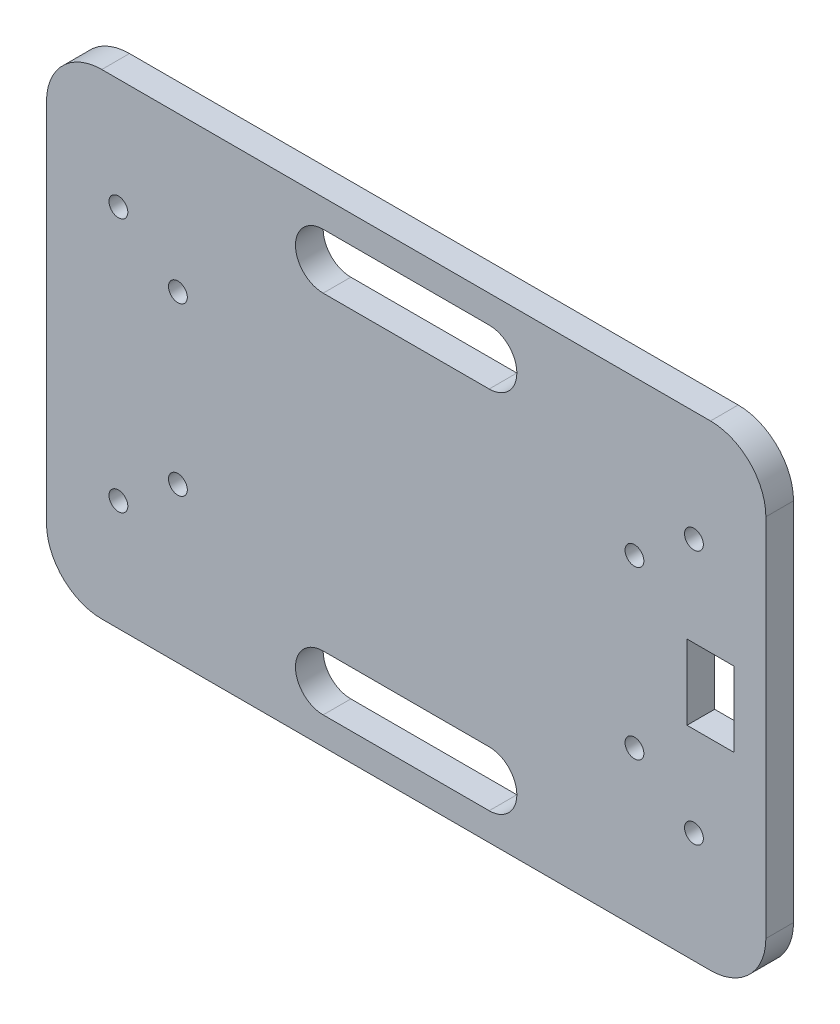
ISO-10303-21;
HEADER;
FILE_DESCRIPTION(('STEP AP214'),'2;1');
FILE_NAME('part.step','',(''),(''),'','','');
FILE_SCHEMA(('AUTOMOTIVE_DESIGN { 1 0 10303 214 1 1 1 1 }'));
ENDSEC;
DATA;
#1=APPLICATION_CONTEXT('core data for automotive mechanical design processes');
#2=APPLICATION_PROTOCOL_DEFINITION('international standard','automotive_design',2000,#1);
#3=PRODUCT_CONTEXT('',#1,'mechanical');
#4=PRODUCT('Part','Part','',(#3));
#5=PRODUCT_RELATED_PRODUCT_CATEGORY('part','',(#4));
#6=PRODUCT_DEFINITION_FORMATION('','',#4);
#7=PRODUCT_DEFINITION_CONTEXT('part definition',#1,'design');
#8=PRODUCT_DEFINITION('design','',#6,#7);
#9=PRODUCT_DEFINITION_SHAPE('','',#8);
#10=(LENGTH_UNIT() NAMED_UNIT(*) SI_UNIT(.MILLI.,.METRE.));
#11=(NAMED_UNIT(*) PLANE_ANGLE_UNIT() SI_UNIT($,.RADIAN.));
#12=(NAMED_UNIT(*) SI_UNIT($,.STERADIAN.) SOLID_ANGLE_UNIT());
#13=UNCERTAINTY_MEASURE_WITH_UNIT(LENGTH_MEASURE(1.E-05),#10,'distance_accuracy_value','');
#14=(GEOMETRIC_REPRESENTATION_CONTEXT(3) GLOBAL_UNCERTAINTY_ASSIGNED_CONTEXT((#13)) GLOBAL_UNIT_ASSIGNED_CONTEXT((#10,
#11,#12)) REPRESENTATION_CONTEXT('',''));
#15=CARTESIAN_POINT('',(0.,0.,0.));
#16=DIRECTION('',(0.,0.,1.));
#17=DIRECTION('',(1.,0.,0.));
#18=AXIS2_PLACEMENT_3D('',#15,#16,#17);
#19=CARTESIAN_POINT('',(-55.,33.,5.));
#20=DIRECTION('',(0.,0.,-1.));
#21=DIRECTION('',(-1.,0.,0.));
#22=AXIS2_PLACEMENT_3D('',#19,#20,#21);
#23=CYLINDRICAL_SURFACE('',#22,10.);
#24=CARTESIAN_POINT('',(-55.,33.,0.));
#25=DIRECTION('',(0.,0.,1.));
#26=DIRECTION('',(-1.,0.,0.));
#27=AXIS2_PLACEMENT_3D('',#24,#25,#26);
#28=CIRCLE('',#27,10.);
#29=CARTESIAN_POINT('',(-55.,43.,0.));
#30=VERTEX_POINT('',#29);
#31=CARTESIAN_POINT('',(-65.,33.,0.));
#32=VERTEX_POINT('',#31);
#33=EDGE_CURVE('E224',#30,#32,#28,.T.);
#34=ORIENTED_EDGE('',*,*,#33,.T.);
#35=DIRECTION('',(0.,0.,-1.));
#36=VECTOR('',#35,1.);
#37=CARTESIAN_POINT('',(-65.,33.,5.));
#38=LINE('',#37,#36);
#39=CARTESIAN_POINT('',(-65.,33.,5.));
#40=VERTEX_POINT('',#39);
#41=EDGE_CURVE('E11',#40,#32,#38,.T.);
#42=ORIENTED_EDGE('',*,*,#41,.F.);
#43=CARTESIAN_POINT('',(-55.,33.,5.));
#44=DIRECTION('',(0.,0.,1.));
#45=DIRECTION('',(-1.,0.,0.));
#46=AXIS2_PLACEMENT_3D('',#43,#44,#45);
#47=CIRCLE('',#46,10.);
#48=CARTESIAN_POINT('',(-55.,43.,5.));
#49=VERTEX_POINT('',#48);
#50=EDGE_CURVE('E378',#49,#40,#47,.T.);
#51=ORIENTED_EDGE('',*,*,#50,.F.);
#52=DIRECTION('',(0.,0.,-1.));
#53=VECTOR('',#52,1.);
#54=CARTESIAN_POINT('',(-55.,43.,5.));
#55=LINE('',#54,#53);
#56=EDGE_CURVE('E404',#49,#30,#55,.T.);
#57=ORIENTED_EDGE('',*,*,#56,.T.);
#58=EDGE_LOOP('',(#34,#42,#51,#57));
#59=FACE_BOUND('',#58,.T.);
#60=ADVANCED_FACE('F39',(#59),#23,.T.);
#61=CARTESIAN_POINT('',(-65.,33.,5.));
#62=DIRECTION('',(1.,0.,0.));
#63=DIRECTION('',(0.,1.,0.));
#64=AXIS2_PLACEMENT_3D('',#61,#62,#63);
#65=PLANE('',#64);
#66=DIRECTION('',(0.,-1.,0.));
#67=VECTOR('',#66,1.);
#68=CARTESIAN_POINT('',(-65.,33.,0.));
#69=LINE('',#68,#67);
#70=CARTESIAN_POINT('',(-65.,-33.,0.));
#71=VERTEX_POINT('',#70);
#72=EDGE_CURVE('E408',#32,#71,#69,.T.);
#73=ORIENTED_EDGE('',*,*,#72,.T.);
#74=DIRECTION('',(0.,0.,-1.));
#75=VECTOR('',#74,1.);
#76=CARTESIAN_POINT('',(-65.,-33.,5.));
#77=LINE('',#76,#75);
#78=CARTESIAN_POINT('',(-65.,-33.,5.));
#79=VERTEX_POINT('',#78);
#80=EDGE_CURVE('E47',#79,#71,#77,.T.);
#81=ORIENTED_EDGE('',*,*,#80,.F.);
#82=DIRECTION('',(0.,-1.,0.));
#83=VECTOR('',#82,1.);
#84=CARTESIAN_POINT('',(-65.,33.,5.));
#85=LINE('',#84,#83);
#86=EDGE_CURVE('E382',#40,#79,#85,.T.);
#87=ORIENTED_EDGE('',*,*,#86,.F.);
#88=ORIENTED_EDGE('',*,*,#41,.T.);
#89=EDGE_LOOP('',(#73,#81,#87,#88));
#90=FACE_BOUND('',#89,.T.);
#91=ADVANCED_FACE('F478',(#90),#65,.F.);
#92=CARTESIAN_POINT('',(-55.,-33.,5.));
#93=DIRECTION('',(0.,0.,-1.));
#94=DIRECTION('',(-1.,0.,0.));
#95=AXIS2_PLACEMENT_3D('',#92,#93,#94);
#96=CYLINDRICAL_SURFACE('',#95,9.99999999999999);
#97=CARTESIAN_POINT('',(-55.,-33.,0.));
#98=DIRECTION('',(0.,0.,1.));
#99=DIRECTION('',(-1.,0.,0.));
#100=AXIS2_PLACEMENT_3D('',#97,#98,#99);
#101=CIRCLE('',#100,9.99999999999999);
#102=CARTESIAN_POINT('',(-55.,-43.,0.));
#103=VERTEX_POINT('',#102);
#104=EDGE_CURVE('E411',#71,#103,#101,.T.);
#105=ORIENTED_EDGE('',*,*,#104,.T.);
#106=DIRECTION('',(0.,0.,-1.));
#107=VECTOR('',#106,1.);
#108=CARTESIAN_POINT('',(-55.,-43.,5.));
#109=LINE('',#108,#107);
#110=CARTESIAN_POINT('',(-55.,-43.,5.));
#111=VERTEX_POINT('',#110);
#112=EDGE_CURVE('E447',#111,#103,#109,.T.);
#113=ORIENTED_EDGE('',*,*,#112,.F.);
#114=CARTESIAN_POINT('',(-55.,-33.,5.));
#115=DIRECTION('',(0.,0.,1.));
#116=DIRECTION('',(-1.,0.,0.));
#117=AXIS2_PLACEMENT_3D('',#114,#115,#116);
#118=CIRCLE('',#117,9.99999999999999);
#119=EDGE_CURVE('E386',#79,#111,#118,.T.);
#120=ORIENTED_EDGE('',*,*,#119,.F.);
#121=ORIENTED_EDGE('',*,*,#80,.T.);
#122=EDGE_LOOP('',(#105,#113,#120,#121));
#123=FACE_BOUND('',#122,.T.);
#124=ADVANCED_FACE('F456',(#123),#96,.T.);
#125=CARTESIAN_POINT('',(-55.,-43.,5.));
#126=DIRECTION('',(0.,1.,0.));
#127=DIRECTION('',(0.,0.,1.));
#128=AXIS2_PLACEMENT_3D('',#125,#126,#127);
#129=PLANE('',#128);
#130=DIRECTION('',(1.,0.,0.));
#131=VECTOR('',#130,1.);
#132=CARTESIAN_POINT('',(-55.,-43.,0.));
#133=LINE('',#132,#131);
#134=CARTESIAN_POINT('',(55.,-43.,0.));
#135=VERTEX_POINT('',#134);
#136=EDGE_CURVE('E414',#103,#135,#133,.T.);
#137=ORIENTED_EDGE('',*,*,#136,.T.);
#138=DIRECTION('',(0.,0.,-1.));
#139=VECTOR('',#138,1.);
#140=CARTESIAN_POINT('',(55.,-43.,5.));
#141=LINE('',#140,#139);
#142=CARTESIAN_POINT('',(55.,-43.,5.));
#143=VERTEX_POINT('',#142);
#144=EDGE_CURVE('E443',#143,#135,#141,.T.);
#145=ORIENTED_EDGE('',*,*,#144,.F.);
#146=DIRECTION('',(1.,0.,0.));
#147=VECTOR('',#146,1.);
#148=CARTESIAN_POINT('',(-55.,-43.,5.));
#149=LINE('',#148,#147);
#150=EDGE_CURVE('E389',#111,#143,#149,.T.);
#151=ORIENTED_EDGE('',*,*,#150,.F.);
#152=ORIENTED_EDGE('',*,*,#112,.T.);
#153=EDGE_LOOP('',(#137,#145,#151,#152));
#154=FACE_BOUND('',#153,.T.);
#155=ADVANCED_FACE('F466',(#154),#129,.F.);
#156=CARTESIAN_POINT('',(55.,-33.,5.));
#157=DIRECTION('',(0.,0.,-1.));
#158=DIRECTION('',(-1.,0.,0.));
#159=AXIS2_PLACEMENT_3D('',#156,#157,#158);
#160=CYLINDRICAL_SURFACE('',#159,10.);
#161=CARTESIAN_POINT('',(55.,-33.,0.));
#162=DIRECTION('',(0.,0.,1.));
#163=DIRECTION('',(1.,0.,0.));
#164=AXIS2_PLACEMENT_3D('',#161,#162,#163);
#165=CIRCLE('',#164,10.);
#166=CARTESIAN_POINT('',(65.,-33.,0.));
#167=VERTEX_POINT('',#166);
#168=EDGE_CURVE('E417',#135,#167,#165,.T.);
#169=ORIENTED_EDGE('',*,*,#168,.T.);
#170=DIRECTION('',(0.,0.,-1.));
#171=VECTOR('',#170,1.);
#172=CARTESIAN_POINT('',(65.,-33.,5.));
#173=LINE('',#172,#171);
#174=CARTESIAN_POINT('',(65.,-33.,5.));
#175=VERTEX_POINT('',#174);
#176=EDGE_CURVE('E439',#175,#167,#173,.T.);
#177=ORIENTED_EDGE('',*,*,#176,.F.);
#178=CARTESIAN_POINT('',(55.,-33.,5.));
#179=DIRECTION('',(0.,0.,1.));
#180=DIRECTION('',(1.,0.,0.));
#181=AXIS2_PLACEMENT_3D('',#178,#179,#180);
#182=CIRCLE('',#181,10.);
#183=EDGE_CURVE('E392',#143,#175,#182,.T.);
#184=ORIENTED_EDGE('',*,*,#183,.F.);
#185=ORIENTED_EDGE('',*,*,#144,.T.);
#186=EDGE_LOOP('',(#169,#177,#184,#185));
#187=FACE_BOUND('',#186,.T.);
#188=ADVANCED_FACE('F470',(#187),#160,.T.);
#189=CARTESIAN_POINT('',(65.,33.,5.));
#190=DIRECTION('',(-1.,0.,0.));
#191=DIRECTION('',(0.,-1.,0.));
#192=AXIS2_PLACEMENT_3D('',#189,#190,#191);
#193=PLANE('',#192);
#194=DIRECTION('',(0.,1.,0.));
#195=VECTOR('',#194,1.);
#196=CARTESIAN_POINT('',(65.,33.,0.));
#197=LINE('',#196,#195);
#198=CARTESIAN_POINT('',(65.,33.,0.));
#199=VERTEX_POINT('',#198);
#200=EDGE_CURVE('E420',#167,#199,#197,.T.);
#201=ORIENTED_EDGE('',*,*,#200,.T.);
#202=DIRECTION('',(0.,0.,-1.));
#203=VECTOR('',#202,1.);
#204=CARTESIAN_POINT('',(65.,33.,5.));
#205=LINE('',#204,#203);
#206=CARTESIAN_POINT('',(65.,33.,5.));
#207=VERTEX_POINT('',#206);
#208=EDGE_CURVE('E435',#207,#199,#205,.T.);
#209=ORIENTED_EDGE('',*,*,#208,.F.);
#210=DIRECTION('',(0.,1.,0.));
#211=VECTOR('',#210,1.);
#212=CARTESIAN_POINT('',(65.,33.,5.));
#213=LINE('',#212,#211);
#214=EDGE_CURVE('E395',#175,#207,#213,.T.);
#215=ORIENTED_EDGE('',*,*,#214,.F.);
#216=ORIENTED_EDGE('',*,*,#176,.T.);
#217=EDGE_LOOP('',(#201,#209,#215,#216));
#218=FACE_BOUND('',#217,.T.);
#219=ADVANCED_FACE('F491',(#218),#193,.F.);
#220=CARTESIAN_POINT('',(55.,33.,5.));
#221=DIRECTION('',(0.,0.,-1.));
#222=DIRECTION('',(-1.,0.,0.));
#223=AXIS2_PLACEMENT_3D('',#220,#221,#222);
#224=CYLINDRICAL_SURFACE('',#223,10.);
#225=CARTESIAN_POINT('',(55.,33.,0.));
#226=DIRECTION('',(0.,0.,1.));
#227=DIRECTION('',(1.,0.,0.));
#228=AXIS2_PLACEMENT_3D('',#225,#226,#227);
#229=CIRCLE('',#228,10.);
#230=CARTESIAN_POINT('',(55.,43.,0.));
#231=VERTEX_POINT('',#230);
#232=EDGE_CURVE('E423',#199,#231,#229,.T.);
#233=ORIENTED_EDGE('',*,*,#232,.T.);
#234=DIRECTION('',(0.,0.,-1.));
#235=VECTOR('',#234,1.);
#236=CARTESIAN_POINT('',(55.,43.,5.));
#237=LINE('',#236,#235);
#238=CARTESIAN_POINT('',(55.,43.,5.));
#239=VERTEX_POINT('',#238);
#240=EDGE_CURVE('E431',#239,#231,#237,.T.);
#241=ORIENTED_EDGE('',*,*,#240,.F.);
#242=CARTESIAN_POINT('',(55.,33.,5.));
#243=DIRECTION('',(0.,0.,1.));
#244=DIRECTION('',(1.,0.,0.));
#245=AXIS2_PLACEMENT_3D('',#242,#243,#244);
#246=CIRCLE('',#245,10.);
#247=EDGE_CURVE('E398',#207,#239,#246,.T.);
#248=ORIENTED_EDGE('',*,*,#247,.F.);
#249=ORIENTED_EDGE('',*,*,#208,.T.);
#250=EDGE_LOOP('',(#233,#241,#248,#249));
#251=FACE_BOUND('',#250,.T.);
#252=ADVANCED_FACE('F489',(#251),#224,.T.);
#253=CARTESIAN_POINT('',(-55.,43.,5.));
#254=DIRECTION('',(0.,-1.,0.));
#255=DIRECTION('',(0.,0.,-1.));
#256=AXIS2_PLACEMENT_3D('',#253,#254,#255);
#257=PLANE('',#256);
#258=DIRECTION('',(-1.,0.,0.));
#259=VECTOR('',#258,1.);
#260=CARTESIAN_POINT('',(-55.,43.,0.));
#261=LINE('',#260,#259);
#262=EDGE_CURVE('E383',#231,#30,#261,.T.);
#263=ORIENTED_EDGE('',*,*,#262,.T.);
#264=ORIENTED_EDGE('',*,*,#56,.F.);
#265=DIRECTION('',(-1.,0.,0.));
#266=VECTOR('',#265,1.);
#267=CARTESIAN_POINT('',(-55.,43.,5.));
#268=LINE('',#267,#266);
#269=EDGE_CURVE('E401',#239,#49,#268,.T.);
#270=ORIENTED_EDGE('',*,*,#269,.F.);
#271=ORIENTED_EDGE('',*,*,#240,.T.);
#272=EDGE_LOOP('',(#263,#264,#270,#271));
#273=FACE_BOUND('',#272,.T.);
#274=ADVANCED_FACE('F484',(#273),#257,.F.);
#275=CARTESIAN_POINT('',(-55.,33.,5.));
#276=DIRECTION('',(0.,0.,-1.));
#277=DIRECTION('',(-1.,0.,0.));
#278=AXIS2_PLACEMENT_3D('',#275,#276,#277);
#279=PLANE('',#278);
#280=CARTESIAN_POINT('',(15.,-33.,5.));
#281=DIRECTION('',(0.,0.,1.));
#282=DIRECTION('',(1.,0.,0.));
#283=AXIS2_PLACEMENT_3D('',#280,#281,#282);
#284=CIRCLE('',#283,5.);
#285=CARTESIAN_POINT('',(15.,-38.,5.));
#286=VERTEX_POINT('',#285);
#287=CARTESIAN_POINT('',(15.,-28.,5.));
#288=VERTEX_POINT('',#287);
#289=EDGE_CURVE('E214',#286,#288,#284,.T.);
#290=ORIENTED_EDGE('',*,*,#289,.F.);
#291=DIRECTION('',(1.,0.,0.));
#292=VECTOR('',#291,1.);
#293=CARTESIAN_POINT('',(0.,-38.,5.));
#294=LINE('',#293,#292);
#295=CARTESIAN_POINT('',(-15.,-38.,5.));
#296=VERTEX_POINT('',#295);
#297=EDGE_CURVE('E54',#296,#286,#294,.T.);
#298=ORIENTED_EDGE('',*,*,#297,.F.);
#299=CARTESIAN_POINT('',(-15.,-33.,5.));
#300=DIRECTION('',(0.,0.,1.));
#301=DIRECTION('',(1.,0.,0.));
#302=AXIS2_PLACEMENT_3D('',#299,#300,#301);
#303=CIRCLE('',#302,5.);
#304=CARTESIAN_POINT('',(-15.,-28.,5.));
#305=VERTEX_POINT('',#304);
#306=EDGE_CURVE('E201',#305,#296,#303,.T.);
#307=ORIENTED_EDGE('',*,*,#306,.F.);
#308=DIRECTION('',(1.,0.,0.));
#309=VECTOR('',#308,1.);
#310=CARTESIAN_POINT('',(0.,-28.,5.));
#311=LINE('',#310,#309);
#312=EDGE_CURVE('E205',#305,#288,#311,.T.);
#313=ORIENTED_EDGE('',*,*,#312,.T.);
#314=EDGE_LOOP('',(#290,#298,#307,#313));
#315=FACE_BOUND('',#314,.T.);
#316=DIRECTION('',(0.,-1.,0.));
#317=VECTOR('',#316,1.);
#318=CARTESIAN_POINT('',(59.25,6.74999999999996,5.));
#319=LINE('',#318,#317);
#320=CARTESIAN_POINT('',(59.25,6.74999999999996,5.));
#321=VERTEX_POINT('',#320);
#322=CARTESIAN_POINT('',(59.25,-6.75000000000004,5.));
#323=VERTEX_POINT('',#322);
#324=EDGE_CURVE('E261',#321,#323,#319,.T.);
#325=ORIENTED_EDGE('',*,*,#324,.T.);
#326=DIRECTION('',(1.,0.,0.));
#327=VECTOR('',#326,1.);
#328=CARTESIAN_POINT('',(50.75,-6.75000000000004,5.));
#329=LINE('',#328,#327);
#330=CARTESIAN_POINT('',(50.75,-6.75000000000004,5.));
#331=VERTEX_POINT('',#330);
#332=EDGE_CURVE('E62',#331,#323,#329,.T.);
#333=ORIENTED_EDGE('',*,*,#332,.F.);
#334=DIRECTION('',(0.,-1.,0.));
#335=VECTOR('',#334,1.);
#336=CARTESIAN_POINT('',(50.75,6.74999999999996,5.));
#337=LINE('',#336,#335);
#338=CARTESIAN_POINT('',(50.75,6.74999999999996,5.));
#339=VERTEX_POINT('',#338);
#340=EDGE_CURVE('E252',#339,#331,#337,.T.);
#341=ORIENTED_EDGE('',*,*,#340,.F.);
#342=DIRECTION('',(1.,0.,0.));
#343=VECTOR('',#342,1.);
#344=CARTESIAN_POINT('',(50.75,6.74999999999996,5.));
#345=LINE('',#344,#343);
#346=EDGE_CURVE('E256',#339,#321,#345,.T.);
#347=ORIENTED_EDGE('',*,*,#346,.T.);
#348=EDGE_LOOP('',(#325,#333,#341,#347));
#349=FACE_BOUND('',#348,.T.);
#350=CARTESIAN_POINT('',(52.,23.0000000000001,5.));
#351=DIRECTION('',(0.,0.,1.));
#352=DIRECTION('',(1.,0.,0.));
#353=AXIS2_PLACEMENT_3D('',#350,#351,#352);
#354=CIRCLE('',#353,1.7);
#355=CARTESIAN_POINT('',(53.7,23.0000000000001,5.));
#356=VERTEX_POINT('',#355);
#357=EDGE_CURVE('E230',#356,#356,#354,.T.);
#358=ORIENTED_EDGE('',*,*,#357,.F.);
#359=EDGE_LOOP('',(#358));
#360=FACE_BOUND('',#359,.T.);
#361=CARTESIAN_POINT('',(15.,33.,5.));
#362=DIRECTION('',(0.,0.,1.));
#363=DIRECTION('',(1.,0.,0.));
#364=AXIS2_PLACEMENT_3D('',#361,#362,#363);
#365=CIRCLE('',#364,5.);
#366=CARTESIAN_POINT('',(15.,28.,5.));
#367=VERTEX_POINT('',#366);
#368=CARTESIAN_POINT('',(15.,38.,5.));
#369=VERTEX_POINT('',#368);
#370=EDGE_CURVE('E336',#367,#369,#365,.T.);
#371=ORIENTED_EDGE('',*,*,#370,.F.);
#372=DIRECTION('',(1.,0.,0.));
#373=VECTOR('',#372,1.);
#374=CARTESIAN_POINT('',(0.,28.,5.));
#375=LINE('',#374,#373);
#376=CARTESIAN_POINT('',(-15.,28.,5.));
#377=VERTEX_POINT('',#376);
#378=EDGE_CURVE('E215',#377,#367,#375,.T.);
#379=ORIENTED_EDGE('',*,*,#378,.F.);
#380=CARTESIAN_POINT('',(-15.,33.,5.));
#381=DIRECTION('',(0.,0.,1.));
#382=DIRECTION('',(1.,0.,0.));
#383=AXIS2_PLACEMENT_3D('',#380,#381,#382);
#384=CIRCLE('',#383,5.);
#385=CARTESIAN_POINT('',(-15.,38.,5.));
#386=VERTEX_POINT('',#385);
#387=EDGE_CURVE('E327',#386,#377,#384,.T.);
#388=ORIENTED_EDGE('',*,*,#387,.F.);
#389=DIRECTION('',(1.,0.,0.));
#390=VECTOR('',#389,1.);
#391=CARTESIAN_POINT('',(0.,38.,5.));
#392=LINE('',#391,#390);
#393=EDGE_CURVE('E331',#386,#369,#392,.T.);
#394=ORIENTED_EDGE('',*,*,#393,.T.);
#395=EDGE_LOOP('',(#371,#379,#388,#394));
#396=FACE_BOUND('',#395,.T.);
#397=CARTESIAN_POINT('',(-52.,23.,5.));
#398=DIRECTION('',(0.,0.,1.));
#399=DIRECTION('',(1.,0.,0.));
#400=AXIS2_PLACEMENT_3D('',#397,#398,#399);
#401=CIRCLE('',#400,1.7);
#402=CARTESIAN_POINT('',(-50.3,23.,5.));
#403=VERTEX_POINT('',#402);
#404=EDGE_CURVE('E326',#403,#403,#401,.T.);
#405=ORIENTED_EDGE('',*,*,#404,.F.);
#406=EDGE_LOOP('',(#405));
#407=FACE_BOUND('',#406,.T.);
#408=CARTESIAN_POINT('',(-41.25,15.075,5.));
#409=DIRECTION('',(0.,0.,1.));
#410=DIRECTION('',(1.,0.,0.));
#411=AXIS2_PLACEMENT_3D('',#408,#409,#410);
#412=CIRCLE('',#411,1.7);
#413=CARTESIAN_POINT('',(-39.55,15.075,5.));
#414=VERTEX_POINT('',#413);
#415=EDGE_CURVE('E363',#414,#414,#412,.T.);
#416=ORIENTED_EDGE('',*,*,#415,.F.);
#417=EDGE_LOOP('',(#416));
#418=FACE_BOUND('',#417,.T.);
#419=CARTESIAN_POINT('',(-41.25,-15.05,5.));
#420=DIRECTION('',(0.,0.,1.));
#421=DIRECTION('',(1.,0.,0.));
#422=AXIS2_PLACEMENT_3D('',#419,#420,#421);
#423=CIRCLE('',#422,1.7);
#424=CARTESIAN_POINT('',(-39.55,-15.05,5.));
#425=VERTEX_POINT('',#424);
#426=EDGE_CURVE('E371',#425,#425,#423,.T.);
#427=ORIENTED_EDGE('',*,*,#426,.F.);
#428=EDGE_LOOP('',(#427));
#429=FACE_BOUND('',#428,.T.);
#430=CARTESIAN_POINT('',(52.,-23.,5.));
#431=DIRECTION('',(0.,0.,1.));
#432=DIRECTION('',(1.,0.,0.));
#433=AXIS2_PLACEMENT_3D('',#430,#431,#432);
#434=CIRCLE('',#433,1.7);
#435=CARTESIAN_POINT('',(53.7,-23.,5.));
#436=VERTEX_POINT('',#435);
#437=EDGE_CURVE('E289',#436,#436,#434,.T.);
#438=ORIENTED_EDGE('',*,*,#437,.F.);
#439=EDGE_LOOP('',(#438));
#440=FACE_BOUND('',#439,.T.);
#441=CARTESIAN_POINT('',(41.25,-15.05,5.));
#442=DIRECTION('',(0.,0.,1.));
#443=DIRECTION('',(1.,0.,0.));
#444=AXIS2_PLACEMENT_3D('',#441,#442,#443);
#445=CIRCLE('',#444,1.7);
#446=CARTESIAN_POINT('',(42.95,-15.05,5.));
#447=VERTEX_POINT('',#446);
#448=EDGE_CURVE('E280',#447,#447,#445,.T.);
#449=ORIENTED_EDGE('',*,*,#448,.F.);
#450=EDGE_LOOP('',(#449));
#451=FACE_BOUND('',#450,.T.);
#452=CARTESIAN_POINT('',(41.25,15.075,5.));
#453=DIRECTION('',(0.,0.,1.));
#454=DIRECTION('',(1.,0.,0.));
#455=AXIS2_PLACEMENT_3D('',#452,#453,#454);
#456=CIRCLE('',#455,1.7);
#457=CARTESIAN_POINT('',(42.95,15.075,5.));
#458=VERTEX_POINT('',#457);
#459=EDGE_CURVE('E305',#458,#458,#456,.T.);
#460=ORIENTED_EDGE('',*,*,#459,.F.);
#461=EDGE_LOOP('',(#460));
#462=FACE_BOUND('',#461,.T.);
#463=CARTESIAN_POINT('',(-52.,-23.,5.));
#464=DIRECTION('',(0.,0.,1.));
#465=DIRECTION('',(1.,0.,0.));
#466=AXIS2_PLACEMENT_3D('',#463,#464,#465);
#467=CIRCLE('',#466,1.7);
#468=CARTESIAN_POINT('',(-50.3,-23.,5.));
#469=VERTEX_POINT('',#468);
#470=EDGE_CURVE('E296',#469,#469,#467,.T.);
#471=ORIENTED_EDGE('',*,*,#470,.F.);
#472=EDGE_LOOP('',(#471));
#473=FACE_BOUND('',#472,.T.);
#474=ORIENTED_EDGE('',*,*,#50,.T.);
#475=ORIENTED_EDGE('',*,*,#86,.T.);
#476=ORIENTED_EDGE('',*,*,#119,.T.);
#477=ORIENTED_EDGE('',*,*,#150,.T.);
#478=ORIENTED_EDGE('',*,*,#183,.T.);
#479=ORIENTED_EDGE('',*,*,#214,.T.);
#480=ORIENTED_EDGE('',*,*,#247,.T.);
#481=ORIENTED_EDGE('',*,*,#269,.T.);
#482=EDGE_LOOP('',(#474,#475,#476,#477,#478,#479,#480,#481));
#483=FACE_BOUND('',#482,.T.);
#484=ADVANCED_FACE('F474',(#315,#349,#360,#396,#407,#418,#429,#440,#451,#462,#473,#483),#279,.F.);
#485=CARTESIAN_POINT('',(-55.,33.,0.));
#486=DIRECTION('',(0.,0.,-1.));
#487=DIRECTION('',(-1.,0.,0.));
#488=AXIS2_PLACEMENT_3D('',#485,#486,#487);
#489=PLANE('',#488);
#490=DIRECTION('',(1.,0.,0.));
#491=VECTOR('',#490,1.);
#492=CARTESIAN_POINT('',(0.,-38.,0.));
#493=LINE('',#492,#491);
#494=CARTESIAN_POINT('',(-15.,-38.,0.));
#495=VERTEX_POINT('',#494);
#496=CARTESIAN_POINT('',(15.,-38.,0.));
#497=VERTEX_POINT('',#496);
#498=EDGE_CURVE('E179',#495,#497,#493,.T.);
#499=ORIENTED_EDGE('',*,*,#498,.T.);
#500=CARTESIAN_POINT('',(15.,-33.,0.));
#501=DIRECTION('',(0.,0.,1.));
#502=DIRECTION('',(1.,0.,0.));
#503=AXIS2_PLACEMENT_3D('',#500,#501,#502);
#504=CIRCLE('',#503,5.);
#505=CARTESIAN_POINT('',(15.,-28.,0.));
#506=VERTEX_POINT('',#505);
#507=EDGE_CURVE('E189',#497,#506,#504,.T.);
#508=ORIENTED_EDGE('',*,*,#507,.T.);
#509=DIRECTION('',(1.,0.,0.));
#510=VECTOR('',#509,1.);
#511=CARTESIAN_POINT('',(0.,-28.,0.));
#512=LINE('',#511,#510);
#513=CARTESIAN_POINT('',(-15.,-28.,0.));
#514=VERTEX_POINT('',#513);
#515=EDGE_CURVE('E195',#514,#506,#512,.T.);
#516=ORIENTED_EDGE('',*,*,#515,.F.);
#517=CARTESIAN_POINT('',(-15.,-33.,0.));
#518=DIRECTION('',(0.,0.,1.));
#519=DIRECTION('',(1.,0.,0.));
#520=AXIS2_PLACEMENT_3D('',#517,#518,#519);
#521=CIRCLE('',#520,5.);
#522=EDGE_CURVE('E186',#514,#495,#521,.T.);
#523=ORIENTED_EDGE('',*,*,#522,.T.);
#524=EDGE_LOOP('',(#499,#508,#516,#523));
#525=FACE_BOUND('',#524,.T.);
#526=DIRECTION('',(1.,0.,0.));
#527=VECTOR('',#526,1.);
#528=CARTESIAN_POINT('',(50.75,-6.75000000000004,0.));
#529=LINE('',#528,#527);
#530=CARTESIAN_POINT('',(50.75,-6.75000000000004,0.));
#531=VERTEX_POINT('',#530);
#532=CARTESIAN_POINT('',(59.25,-6.75000000000004,0.));
#533=VERTEX_POINT('',#532);
#534=EDGE_CURVE('E257',#531,#533,#529,.T.);
#535=ORIENTED_EDGE('',*,*,#534,.T.);
#536=DIRECTION('',(0.,-1.,0.));
#537=VECTOR('',#536,1.);
#538=CARTESIAN_POINT('',(59.25,6.74999999999996,0.));
#539=LINE('',#538,#537);
#540=CARTESIAN_POINT('',(59.25,6.74999999999996,0.));
#541=VERTEX_POINT('',#540);
#542=EDGE_CURVE('E274',#541,#533,#539,.T.);
#543=ORIENTED_EDGE('',*,*,#542,.F.);
#544=DIRECTION('',(1.,0.,0.));
#545=VECTOR('',#544,1.);
#546=CARTESIAN_POINT('',(50.75,6.74999999999996,0.));
#547=LINE('',#546,#545);
#548=CARTESIAN_POINT('',(50.75,6.74999999999996,0.));
#549=VERTEX_POINT('',#548);
#550=EDGE_CURVE('E270',#549,#541,#547,.T.);
#551=ORIENTED_EDGE('',*,*,#550,.F.);
#552=DIRECTION('',(0.,-1.,0.));
#553=VECTOR('',#552,1.);
#554=CARTESIAN_POINT('',(50.75,6.74999999999996,0.));
#555=LINE('',#554,#553);
#556=EDGE_CURVE('E242',#549,#531,#555,.T.);
#557=ORIENTED_EDGE('',*,*,#556,.T.);
#558=EDGE_LOOP('',(#535,#543,#551,#557));
#559=FACE_BOUND('',#558,.T.);
#560=CARTESIAN_POINT('',(52.,23.0000000000001,0.));
#561=DIRECTION('',(0.,0.,1.));
#562=DIRECTION('',(1.,0.,0.));
#563=AXIS2_PLACEMENT_3D('',#560,#561,#562);
#564=CIRCLE('',#563,1.7);
#565=CARTESIAN_POINT('',(53.7,23.0000000000001,0.));
#566=VERTEX_POINT('',#565);
#567=EDGE_CURVE('E235',#566,#566,#564,.T.);
#568=ORIENTED_EDGE('',*,*,#567,.T.);
#569=EDGE_LOOP('',(#568));
#570=FACE_BOUND('',#569,.T.);
#571=DIRECTION('',(1.,0.,0.));
#572=VECTOR('',#571,1.);
#573=CARTESIAN_POINT('',(0.,28.,0.));
#574=LINE('',#573,#572);
#575=CARTESIAN_POINT('',(-15.,28.,0.));
#576=VERTEX_POINT('',#575);
#577=CARTESIAN_POINT('',(15.,28.,0.));
#578=VERTEX_POINT('',#577);
#579=EDGE_CURVE('E332',#576,#578,#574,.T.);
#580=ORIENTED_EDGE('',*,*,#579,.T.);
#581=CARTESIAN_POINT('',(15.,33.,0.));
#582=DIRECTION('',(0.,0.,1.));
#583=DIRECTION('',(1.,0.,0.));
#584=AXIS2_PLACEMENT_3D('',#581,#582,#583);
#585=CIRCLE('',#584,5.);
#586=CARTESIAN_POINT('',(15.,38.,0.));
#587=VERTEX_POINT('',#586);
#588=EDGE_CURVE('E349',#578,#587,#585,.T.);
#589=ORIENTED_EDGE('',*,*,#588,.T.);
#590=DIRECTION('',(1.,0.,0.));
#591=VECTOR('',#590,1.);
#592=CARTESIAN_POINT('',(0.,38.,0.));
#593=LINE('',#592,#591);
#594=CARTESIAN_POINT('',(-15.,38.,0.));
#595=VERTEX_POINT('',#594);
#596=EDGE_CURVE('E345',#595,#587,#593,.T.);
#597=ORIENTED_EDGE('',*,*,#596,.F.);
#598=CARTESIAN_POINT('',(-15.,33.,0.));
#599=DIRECTION('',(0.,0.,1.));
#600=DIRECTION('',(1.,0.,0.));
#601=AXIS2_PLACEMENT_3D('',#598,#599,#600);
#602=CIRCLE('',#601,5.);
#603=EDGE_CURVE('E316',#595,#576,#602,.T.);
#604=ORIENTED_EDGE('',*,*,#603,.T.);
#605=EDGE_LOOP('',(#580,#589,#597,#604));
#606=FACE_BOUND('',#605,.T.);
#607=CARTESIAN_POINT('',(-52.,23.,0.));
#608=DIRECTION('',(0.,0.,1.));
#609=DIRECTION('',(1.,0.,0.));
#610=AXIS2_PLACEMENT_3D('',#607,#608,#609);
#611=CIRCLE('',#610,1.7);
#612=CARTESIAN_POINT('',(-50.3,23.,0.));
#613=VERTEX_POINT('',#612);
#614=EDGE_CURVE('E359',#613,#613,#611,.T.);
#615=ORIENTED_EDGE('',*,*,#614,.T.);
#616=EDGE_LOOP('',(#615));
#617=FACE_BOUND('',#616,.T.);
#618=CARTESIAN_POINT('',(-41.25,15.075,0.));
#619=DIRECTION('',(0.,0.,1.));
#620=DIRECTION('',(1.,0.,0.));
#621=AXIS2_PLACEMENT_3D('',#618,#619,#620);
#622=CIRCLE('',#621,1.7);
#623=CARTESIAN_POINT('',(-39.55,15.075,0.));
#624=VERTEX_POINT('',#623);
#625=EDGE_CURVE('E367',#624,#624,#622,.T.);
#626=ORIENTED_EDGE('',*,*,#625,.T.);
#627=EDGE_LOOP('',(#626));
#628=FACE_BOUND('',#627,.T.);
#629=CARTESIAN_POINT('',(-41.25,-15.05,0.));
#630=DIRECTION('',(0.,0.,1.));
#631=DIRECTION('',(1.,0.,0.));
#632=AXIS2_PLACEMENT_3D('',#629,#630,#631);
#633=CIRCLE('',#632,1.7);
#634=CARTESIAN_POINT('',(-39.55,-15.05,0.));
#635=VERTEX_POINT('',#634);
#636=EDGE_CURVE('E300',#635,#635,#633,.T.);
#637=ORIENTED_EDGE('',*,*,#636,.T.);
#638=EDGE_LOOP('',(#637));
#639=FACE_BOUND('',#638,.T.);
#640=CARTESIAN_POINT('',(52.,-23.,0.));
#641=DIRECTION('',(0.,0.,1.));
#642=DIRECTION('',(1.,0.,0.));
#643=AXIS2_PLACEMENT_3D('',#640,#641,#642);
#644=CIRCLE('',#643,1.7);
#645=CARTESIAN_POINT('',(53.7,-23.,0.));
#646=VERTEX_POINT('',#645);
#647=EDGE_CURVE('E234',#646,#646,#644,.T.);
#648=ORIENTED_EDGE('',*,*,#647,.T.);
#649=EDGE_LOOP('',(#648));
#650=FACE_BOUND('',#649,.T.);
#651=CARTESIAN_POINT('',(41.25,-15.05,0.));
#652=DIRECTION('',(0.,0.,1.));
#653=DIRECTION('',(1.,0.,0.));
#654=AXIS2_PLACEMENT_3D('',#651,#652,#653);
#655=CIRCLE('',#654,1.7);
#656=CARTESIAN_POINT('',(42.95,-15.05,0.));
#657=VERTEX_POINT('',#656);
#658=EDGE_CURVE('E285',#657,#657,#655,.T.);
#659=ORIENTED_EDGE('',*,*,#658,.T.);
#660=EDGE_LOOP('',(#659));
#661=FACE_BOUND('',#660,.T.);
#662=CARTESIAN_POINT('',(41.25,15.075,0.));
#663=DIRECTION('',(0.,0.,1.));
#664=DIRECTION('',(1.,0.,0.));
#665=AXIS2_PLACEMENT_3D('',#662,#663,#664);
#666=CIRCLE('',#665,1.7);
#667=CARTESIAN_POINT('',(42.95,15.075,0.));
#668=VERTEX_POINT('',#667);
#669=EDGE_CURVE('E284',#668,#668,#666,.T.);
#670=ORIENTED_EDGE('',*,*,#669,.T.);
#671=EDGE_LOOP('',(#670));
#672=FACE_BOUND('',#671,.T.);
#673=CARTESIAN_POINT('',(-52.,-23.,0.));
#674=DIRECTION('',(0.,0.,1.));
#675=DIRECTION('',(1.,0.,0.));
#676=AXIS2_PLACEMENT_3D('',#673,#674,#675);
#677=CIRCLE('',#676,1.7);
#678=CARTESIAN_POINT('',(-50.3,-23.,0.));
#679=VERTEX_POINT('',#678);
#680=EDGE_CURVE('E301',#679,#679,#677,.T.);
#681=ORIENTED_EDGE('',*,*,#680,.T.);
#682=EDGE_LOOP('',(#681));
#683=FACE_BOUND('',#682,.T.);
#684=ORIENTED_EDGE('',*,*,#33,.F.);
#685=ORIENTED_EDGE('',*,*,#262,.F.);
#686=ORIENTED_EDGE('',*,*,#232,.F.);
#687=ORIENTED_EDGE('',*,*,#200,.F.);
#688=ORIENTED_EDGE('',*,*,#168,.F.);
#689=ORIENTED_EDGE('',*,*,#136,.F.);
#690=ORIENTED_EDGE('',*,*,#104,.F.);
#691=ORIENTED_EDGE('',*,*,#72,.F.);
#692=EDGE_LOOP('',(#684,#685,#686,#687,#688,#689,#690,#691));
#693=FACE_BOUND('',#692,.T.);
#694=ADVANCED_FACE('F197',(#525,#559,#570,#606,#617,#628,#639,#650,#661,#672,#683,#693),#489,.T.);
#695=CARTESIAN_POINT('',(-52.,-23.,0.));
#696=DIRECTION('',(0.,0.,1.));
#697=DIRECTION('',(1.,0.,0.));
#698=AXIS2_PLACEMENT_3D('',#695,#696,#697);
#699=CYLINDRICAL_SURFACE('',#698,1.7);
#700=ORIENTED_EDGE('',*,*,#680,.F.);
#701=EDGE_LOOP('',(#700));
#702=FACE_BOUND('',#701,.T.);
#703=ORIENTED_EDGE('',*,*,#470,.T.);
#704=EDGE_LOOP('',(#703));
#705=FACE_BOUND('',#704,.T.);
#706=ADVANCED_FACE('F554',(#702,#705),#699,.F.);
#707=CARTESIAN_POINT('',(41.25,15.075,0.));
#708=DIRECTION('',(0.,0.,1.));
#709=DIRECTION('',(1.,0.,0.));
#710=AXIS2_PLACEMENT_3D('',#707,#708,#709);
#711=CYLINDRICAL_SURFACE('',#710,1.7);
#712=ORIENTED_EDGE('',*,*,#669,.F.);
#713=EDGE_LOOP('',(#712));
#714=FACE_BOUND('',#713,.T.);
#715=ORIENTED_EDGE('',*,*,#459,.T.);
#716=EDGE_LOOP('',(#715));
#717=FACE_BOUND('',#716,.T.);
#718=ADVANCED_FACE('F563',(#714,#717),#711,.F.);
#719=CARTESIAN_POINT('',(41.25,-15.05,0.));
#720=DIRECTION('',(0.,0.,1.));
#721=DIRECTION('',(1.,0.,0.));
#722=AXIS2_PLACEMENT_3D('',#719,#720,#721);
#723=CYLINDRICAL_SURFACE('',#722,1.7);
#724=ORIENTED_EDGE('',*,*,#658,.F.);
#725=EDGE_LOOP('',(#724));
#726=FACE_BOUND('',#725,.T.);
#727=ORIENTED_EDGE('',*,*,#448,.T.);
#728=EDGE_LOOP('',(#727));
#729=FACE_BOUND('',#728,.T.);
#730=ADVANCED_FACE('F573',(#726,#729),#723,.F.);
#731=CARTESIAN_POINT('',(52.,-23.,0.));
#732=DIRECTION('',(0.,0.,1.));
#733=DIRECTION('',(1.,0.,0.));
#734=AXIS2_PLACEMENT_3D('',#731,#732,#733);
#735=CYLINDRICAL_SURFACE('',#734,1.7);
#736=ORIENTED_EDGE('',*,*,#647,.F.);
#737=EDGE_LOOP('',(#736));
#738=FACE_BOUND('',#737,.T.);
#739=ORIENTED_EDGE('',*,*,#437,.T.);
#740=EDGE_LOOP('',(#739));
#741=FACE_BOUND('',#740,.T.);
#742=ADVANCED_FACE('F583',(#738,#741),#735,.F.);
#743=CARTESIAN_POINT('',(-41.25,-15.05,0.));
#744=DIRECTION('',(0.,0.,1.));
#745=DIRECTION('',(1.,0.,0.));
#746=AXIS2_PLACEMENT_3D('',#743,#744,#745);
#747=CYLINDRICAL_SURFACE('',#746,1.7);
#748=ORIENTED_EDGE('',*,*,#636,.F.);
#749=EDGE_LOOP('',(#748));
#750=FACE_BOUND('',#749,.T.);
#751=ORIENTED_EDGE('',*,*,#426,.T.);
#752=EDGE_LOOP('',(#751));
#753=FACE_BOUND('',#752,.T.);
#754=ADVANCED_FACE('F593',(#750,#753),#747,.F.);
#755=CARTESIAN_POINT('',(-41.25,15.075,0.));
#756=DIRECTION('',(0.,0.,1.));
#757=DIRECTION('',(1.,0.,0.));
#758=AXIS2_PLACEMENT_3D('',#755,#756,#757);
#759=CYLINDRICAL_SURFACE('',#758,1.7);
#760=ORIENTED_EDGE('',*,*,#625,.F.);
#761=EDGE_LOOP('',(#760));
#762=FACE_BOUND('',#761,.T.);
#763=ORIENTED_EDGE('',*,*,#415,.T.);
#764=EDGE_LOOP('',(#763));
#765=FACE_BOUND('',#764,.T.);
#766=ADVANCED_FACE('F603',(#762,#765),#759,.F.);
#767=CARTESIAN_POINT('',(-52.,23.,0.));
#768=DIRECTION('',(0.,0.,1.));
#769=DIRECTION('',(1.,0.,0.));
#770=AXIS2_PLACEMENT_3D('',#767,#768,#769);
#771=CYLINDRICAL_SURFACE('',#770,1.7);
#772=ORIENTED_EDGE('',*,*,#614,.F.);
#773=EDGE_LOOP('',(#772));
#774=FACE_BOUND('',#773,.T.);
#775=ORIENTED_EDGE('',*,*,#404,.T.);
#776=EDGE_LOOP('',(#775));
#777=FACE_BOUND('',#776,.T.);
#778=ADVANCED_FACE('F613',(#774,#777),#771,.F.);
#779=CARTESIAN_POINT('',(0.,28.,0.));
#780=DIRECTION('',(0.,-1.,0.));
#781=DIRECTION('',(1.,0.,0.));
#782=AXIS2_PLACEMENT_3D('',#779,#780,#781);
#783=PLANE('',#782);
#784=ORIENTED_EDGE('',*,*,#378,.T.);
#785=DIRECTION('',(0.,0.,1.));
#786=VECTOR('',#785,1.);
#787=CARTESIAN_POINT('',(15.,28.,0.));
#788=LINE('',#787,#786);
#789=EDGE_CURVE('E312',#578,#367,#788,.T.);
#790=ORIENTED_EDGE('',*,*,#789,.F.);
#791=ORIENTED_EDGE('',*,*,#579,.F.);
#792=DIRECTION('',(0.,0.,1.));
#793=VECTOR('',#792,1.);
#794=CARTESIAN_POINT('',(-15.,28.,0.));
#795=LINE('',#794,#793);
#796=EDGE_CURVE('E323',#576,#377,#795,.T.);
#797=ORIENTED_EDGE('',*,*,#796,.T.);
#798=EDGE_LOOP('',(#784,#790,#791,#797));
#799=FACE_BOUND('',#798,.T.);
#800=ADVANCED_FACE('F623',(#799),#783,.F.);
#801=CARTESIAN_POINT('',(-15.,33.,0.));
#802=DIRECTION('',(0.,0.,1.));
#803=DIRECTION('',(1.,0.,0.));
#804=AXIS2_PLACEMENT_3D('',#801,#802,#803);
#805=CYLINDRICAL_SURFACE('',#804,5.);
#806=ORIENTED_EDGE('',*,*,#387,.T.);
#807=ORIENTED_EDGE('',*,*,#796,.F.);
#808=ORIENTED_EDGE('',*,*,#603,.F.);
#809=DIRECTION('',(0.,0.,1.));
#810=VECTOR('',#809,1.);
#811=CARTESIAN_POINT('',(-15.,38.,0.));
#812=LINE('',#811,#810);
#813=EDGE_CURVE('E320',#595,#386,#812,.T.);
#814=ORIENTED_EDGE('',*,*,#813,.T.);
#815=EDGE_LOOP('',(#806,#807,#808,#814));
#816=FACE_BOUND('',#815,.T.);
#817=ADVANCED_FACE('F633',(#816),#805,.F.);
#818=CARTESIAN_POINT('',(0.,38.,0.));
#819=DIRECTION('',(0.,-1.,0.));
#820=DIRECTION('',(1.,0.,0.));
#821=AXIS2_PLACEMENT_3D('',#818,#819,#820);
#822=PLANE('',#821);
#823=ORIENTED_EDGE('',*,*,#393,.F.);
#824=ORIENTED_EDGE('',*,*,#813,.F.);
#825=ORIENTED_EDGE('',*,*,#596,.T.);
#826=DIRECTION('',(0.,0.,1.));
#827=VECTOR('',#826,1.);
#828=CARTESIAN_POINT('',(15.,38.,0.));
#829=LINE('',#828,#827);
#830=EDGE_CURVE('E317',#587,#369,#829,.T.);
#831=ORIENTED_EDGE('',*,*,#830,.T.);
#832=EDGE_LOOP('',(#823,#824,#825,#831));
#833=FACE_BOUND('',#832,.T.);
#834=ADVANCED_FACE('F643',(#833),#822,.T.);
#835=CARTESIAN_POINT('',(15.,33.,0.));
#836=DIRECTION('',(0.,0.,1.));
#837=DIRECTION('',(1.,0.,0.));
#838=AXIS2_PLACEMENT_3D('',#835,#836,#837);
#839=CYLINDRICAL_SURFACE('',#838,5.);
#840=ORIENTED_EDGE('',*,*,#370,.T.);
#841=ORIENTED_EDGE('',*,*,#830,.F.);
#842=ORIENTED_EDGE('',*,*,#588,.F.);
#843=ORIENTED_EDGE('',*,*,#789,.T.);
#844=EDGE_LOOP('',(#840,#841,#842,#843));
#845=FACE_BOUND('',#844,.T.);
#846=ADVANCED_FACE('F653',(#845),#839,.F.);
#847=CARTESIAN_POINT('',(52.,23.0000000000001,0.));
#848=DIRECTION('',(0.,0.,1.));
#849=DIRECTION('',(1.,0.,0.));
#850=AXIS2_PLACEMENT_3D('',#847,#848,#849);
#851=CYLINDRICAL_SURFACE('',#850,1.7);
#852=ORIENTED_EDGE('',*,*,#567,.F.);
#853=EDGE_LOOP('',(#852));
#854=FACE_BOUND('',#853,.T.);
#855=ORIENTED_EDGE('',*,*,#357,.T.);
#856=EDGE_LOOP('',(#855));
#857=FACE_BOUND('',#856,.T.);
#858=ADVANCED_FACE('F663',(#854,#857),#851,.F.);
#859=CARTESIAN_POINT('',(50.75,-6.75000000000004,0.));
#860=DIRECTION('',(0.,-1.,0.));
#861=DIRECTION('',(0.,0.,-1.));
#862=AXIS2_PLACEMENT_3D('',#859,#860,#861);
#863=PLANE('',#862);
#864=ORIENTED_EDGE('',*,*,#332,.T.);
#865=DIRECTION('',(0.,0.,1.));
#866=VECTOR('',#865,1.);
#867=CARTESIAN_POINT('',(59.25,-6.75000000000004,0.));
#868=LINE('',#867,#866);
#869=EDGE_CURVE('E239',#533,#323,#868,.T.);
#870=ORIENTED_EDGE('',*,*,#869,.F.);
#871=ORIENTED_EDGE('',*,*,#534,.F.);
#872=DIRECTION('',(0.,0.,1.));
#873=VECTOR('',#872,1.);
#874=CARTESIAN_POINT('',(50.75,-6.75000000000004,0.));
#875=LINE('',#874,#873);
#876=EDGE_CURVE('E249',#531,#331,#875,.T.);
#877=ORIENTED_EDGE('',*,*,#876,.T.);
#878=EDGE_LOOP('',(#864,#870,#871,#877));
#879=FACE_BOUND('',#878,.T.);
#880=ADVANCED_FACE('F673',(#879),#863,.F.);
#881=CARTESIAN_POINT('',(50.75,6.74999999999996,0.));
#882=DIRECTION('',(-1.,0.,0.));
#883=DIRECTION('',(0.,0.,1.));
#884=AXIS2_PLACEMENT_3D('',#881,#882,#883);
#885=PLANE('',#884);
#886=ORIENTED_EDGE('',*,*,#340,.T.);
#887=ORIENTED_EDGE('',*,*,#876,.F.);
#888=ORIENTED_EDGE('',*,*,#556,.F.);
#889=DIRECTION('',(0.,0.,1.));
#890=VECTOR('',#889,1.);
#891=CARTESIAN_POINT('',(50.75,6.74999999999996,0.));
#892=LINE('',#891,#890);
#893=EDGE_CURVE('E246',#549,#339,#892,.T.);
#894=ORIENTED_EDGE('',*,*,#893,.T.);
#895=EDGE_LOOP('',(#886,#887,#888,#894));
#896=FACE_BOUND('',#895,.T.);
#897=ADVANCED_FACE('F683',(#896),#885,.F.);
#898=CARTESIAN_POINT('',(50.75,6.74999999999996,0.));
#899=DIRECTION('',(0.,-1.,0.));
#900=DIRECTION('',(0.,0.,-1.));
#901=AXIS2_PLACEMENT_3D('',#898,#899,#900);
#902=PLANE('',#901);
#903=ORIENTED_EDGE('',*,*,#346,.F.);
#904=ORIENTED_EDGE('',*,*,#893,.F.);
#905=ORIENTED_EDGE('',*,*,#550,.T.);
#906=DIRECTION('',(0.,0.,1.));
#907=VECTOR('',#906,1.);
#908=CARTESIAN_POINT('',(59.25,6.74999999999996,0.));
#909=LINE('',#908,#907);
#910=EDGE_CURVE('E243',#541,#321,#909,.T.);
#911=ORIENTED_EDGE('',*,*,#910,.T.);
#912=EDGE_LOOP('',(#903,#904,#905,#911));
#913=FACE_BOUND('',#912,.T.);
#914=ADVANCED_FACE('F692',(#913),#902,.T.);
#915=CARTESIAN_POINT('',(59.25,6.74999999999996,0.));
#916=DIRECTION('',(-1.,0.,0.));
#917=DIRECTION('',(0.,0.,1.));
#918=AXIS2_PLACEMENT_3D('',#915,#916,#917);
#919=PLANE('',#918);
#920=ORIENTED_EDGE('',*,*,#324,.F.);
#921=ORIENTED_EDGE('',*,*,#910,.F.);
#922=ORIENTED_EDGE('',*,*,#542,.T.);
#923=ORIENTED_EDGE('',*,*,#869,.T.);
#924=EDGE_LOOP('',(#920,#921,#922,#923));
#925=FACE_BOUND('',#924,.T.);
#926=ADVANCED_FACE('F702',(#925),#919,.T.);
#927=CARTESIAN_POINT('',(0.,-38.,0.));
#928=DIRECTION('',(0.,-1.,0.));
#929=DIRECTION('',(1.,0.,0.));
#930=AXIS2_PLACEMENT_3D('',#927,#928,#929);
#931=PLANE('',#930);
#932=ORIENTED_EDGE('',*,*,#297,.T.);
#933=DIRECTION('',(0.,0.,1.));
#934=VECTOR('',#933,1.);
#935=CARTESIAN_POINT('',(15.,-38.,0.));
#936=LINE('',#935,#934);
#937=EDGE_CURVE('E175',#497,#286,#936,.T.);
#938=ORIENTED_EDGE('',*,*,#937,.F.);
#939=ORIENTED_EDGE('',*,*,#498,.F.);
#940=DIRECTION('',(0.,0.,1.));
#941=VECTOR('',#940,1.);
#942=CARTESIAN_POINT('',(-15.,-38.,0.));
#943=LINE('',#942,#941);
#944=EDGE_CURVE('E221',#495,#296,#943,.T.);
#945=ORIENTED_EDGE('',*,*,#944,.T.);
#946=EDGE_LOOP('',(#932,#938,#939,#945));
#947=FACE_BOUND('',#946,.T.);
#948=ADVANCED_FACE('F177',(#947),#931,.F.);
#949=CARTESIAN_POINT('',(-15.,-33.,0.));
#950=DIRECTION('',(0.,0.,1.));
#951=DIRECTION('',(1.,0.,0.));
#952=AXIS2_PLACEMENT_3D('',#949,#950,#951);
#953=CYLINDRICAL_SURFACE('',#952,5.);
#954=ORIENTED_EDGE('',*,*,#306,.T.);
#955=ORIENTED_EDGE('',*,*,#944,.F.);
#956=ORIENTED_EDGE('',*,*,#522,.F.);
#957=DIRECTION('',(0.,0.,1.));
#958=VECTOR('',#957,1.);
#959=CARTESIAN_POINT('',(-15.,-28.,0.));
#960=LINE('',#959,#958);
#961=EDGE_CURVE('E225',#514,#305,#960,.T.);
#962=ORIENTED_EDGE('',*,*,#961,.T.);
#963=EDGE_LOOP('',(#954,#955,#956,#962));
#964=FACE_BOUND('',#963,.T.);
#965=ADVANCED_FACE('F721',(#964),#953,.F.);
#966=CARTESIAN_POINT('',(0.,-28.,0.));
#967=DIRECTION('',(0.,-1.,0.));
#968=DIRECTION('',(1.,0.,0.));
#969=AXIS2_PLACEMENT_3D('',#966,#967,#968);
#970=PLANE('',#969);
#971=ORIENTED_EDGE('',*,*,#312,.F.);
#972=ORIENTED_EDGE('',*,*,#961,.F.);
#973=ORIENTED_EDGE('',*,*,#515,.T.);
#974=DIRECTION('',(0.,0.,1.));
#975=VECTOR('',#974,1.);
#976=CARTESIAN_POINT('',(15.,-28.,0.));
#977=LINE('',#976,#975);
#978=EDGE_CURVE('E185',#506,#288,#977,.T.);
#979=ORIENTED_EDGE('',*,*,#978,.T.);
#980=EDGE_LOOP('',(#971,#972,#973,#979));
#981=FACE_BOUND('',#980,.T.);
#982=ADVANCED_FACE('F730',(#981),#970,.T.);
#983=CARTESIAN_POINT('',(15.,-33.,0.));
#984=DIRECTION('',(0.,0.,1.));
#985=DIRECTION('',(1.,0.,0.));
#986=AXIS2_PLACEMENT_3D('',#983,#984,#985);
#987=CYLINDRICAL_SURFACE('',#986,5.);
#988=ORIENTED_EDGE('',*,*,#289,.T.);
#989=ORIENTED_EDGE('',*,*,#978,.F.);
#990=ORIENTED_EDGE('',*,*,#507,.F.);
#991=ORIENTED_EDGE('',*,*,#937,.T.);
#992=EDGE_LOOP('',(#988,#989,#990,#991));
#993=FACE_BOUND('',#992,.T.);
#994=ADVANCED_FACE('F190',(#993),#987,.F.);
#995=CLOSED_SHELL('',(#60,#91,#124,#155,#188,#219,#252,#274,#484,#694,#706,#718,#730,#742,#754,
#766,#778,#800,#817,#834,#846,#858,#880,#897,#914,#926,#948,#965,#982,#994));
#996=MANIFOLD_SOLID_BREP('B2',#995);
#997=ADVANCED_BREP_SHAPE_REPRESENTATION('',(#18,#996),#14);
#998=SHAPE_DEFINITION_REPRESENTATION(#9,#997);
ENDSEC;
END-ISO-10303-21;
